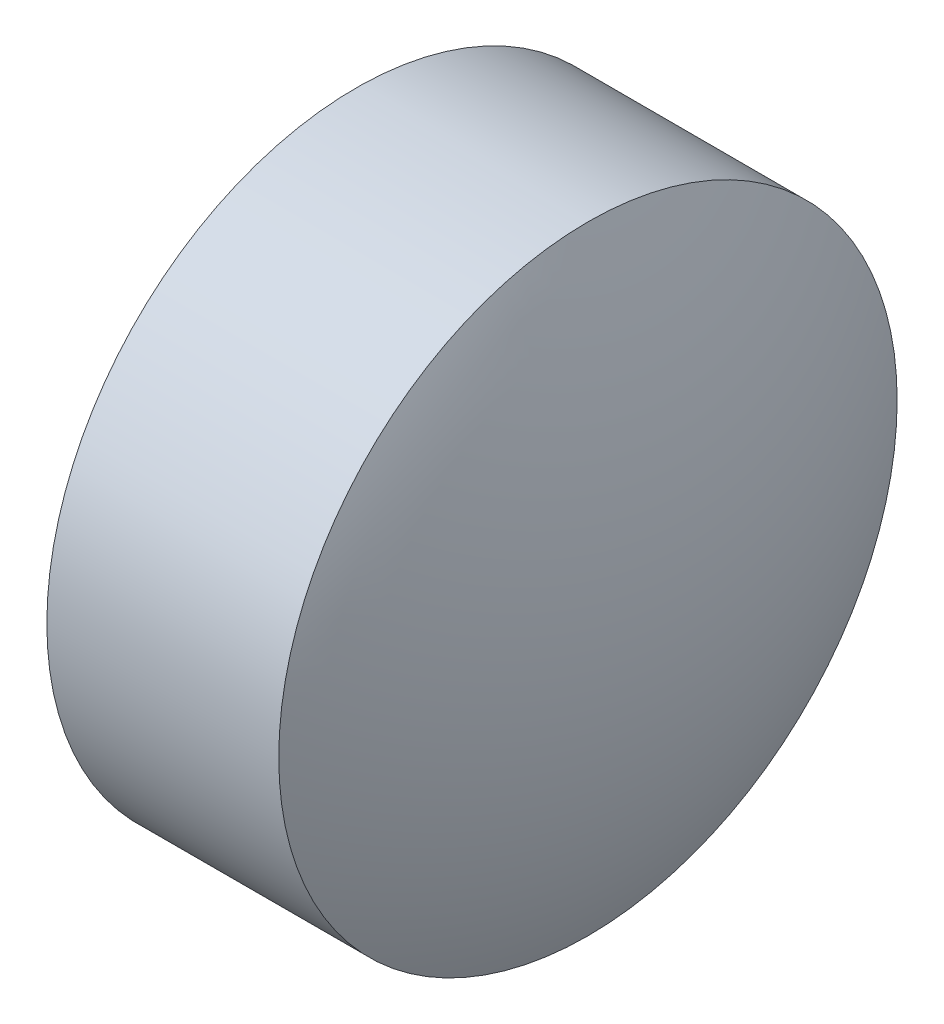
ISO-10303-21;
HEADER;
FILE_DESCRIPTION(('STEP AP214'),'2;1');
FILE_NAME('part.step','',(''),(''),'','','');
FILE_SCHEMA(('AUTOMOTIVE_DESIGN { 1 0 10303 214 1 1 1 1 }'));
ENDSEC;
DATA;
#1=APPLICATION_CONTEXT('core data for automotive mechanical design processes');
#2=APPLICATION_PROTOCOL_DEFINITION('international standard','automotive_design',2000,#1);
#3=PRODUCT_CONTEXT('',#1,'mechanical');
#4=PRODUCT('Part','Part','',(#3));
#5=PRODUCT_RELATED_PRODUCT_CATEGORY('part','',(#4));
#6=PRODUCT_DEFINITION_FORMATION('','',#4);
#7=PRODUCT_DEFINITION_CONTEXT('part definition',#1,'design');
#8=PRODUCT_DEFINITION('design','',#6,#7);
#9=PRODUCT_DEFINITION_SHAPE('','',#8);
#10=(LENGTH_UNIT() NAMED_UNIT(*) SI_UNIT(.MILLI.,.METRE.));
#11=(NAMED_UNIT(*) PLANE_ANGLE_UNIT() SI_UNIT($,.RADIAN.));
#12=(NAMED_UNIT(*) SI_UNIT($,.STERADIAN.) SOLID_ANGLE_UNIT());
#13=UNCERTAINTY_MEASURE_WITH_UNIT(LENGTH_MEASURE(1.E-05),#10,'distance_accuracy_value','');
#14=(GEOMETRIC_REPRESENTATION_CONTEXT(3) GLOBAL_UNCERTAINTY_ASSIGNED_CONTEXT((#13)) GLOBAL_UNIT_ASSIGNED_CONTEXT((#10,
#11,#12)) REPRESENTATION_CONTEXT('',''));
#15=CARTESIAN_POINT('',(0.,0.,0.));
#16=DIRECTION('',(0.,0.,1.));
#17=DIRECTION('',(1.,0.,0.));
#18=AXIS2_PLACEMENT_3D('',#15,#16,#17);
#19=CARTESIAN_POINT('',(414.367091633163,167.108864965034,0.));
#20=DIRECTION('',(-1.,0.,0.));
#21=DIRECTION('',(0.,1.,0.));
#22=AXIS2_PLACEMENT_3D('',#19,#20,#21);
#23=SPHERICAL_SURFACE('',#22,4.57782608695656);
#24=CARTESIAN_POINT('',(418.48491772012,167.108864965034,0.));
#25=DIRECTION('',(-1.,0.,0.));
#26=DIRECTION('',(0.,0.,1.));
#27=AXIS2_PLACEMENT_3D('',#24,#25,#26);
#28=CIRCLE('',#27,2.);
#29=CARTESIAN_POINT('',(418.48491772012,167.108864965034,2.));
#30=VERTEX_POINT('',#29);
#31=EDGE_CURVE('E10',#30,#30,#28,.T.);
#32=ORIENTED_EDGE('',*,*,#31,.F.);
#33=EDGE_LOOP('',(#32));
#34=FACE_BOUND('',#33,.T.);
#35=ADVANCED_FACE('F35',(#34),#23,.T.);
#36=CARTESIAN_POINT('',(416.556811026073,167.108864965034,0.));
#37=DIRECTION('',(-1.,0.,0.));
#38=DIRECTION('',(0.,0.,1.));
#39=AXIS2_PLACEMENT_3D('',#36,#37,#38);
#40=CYLINDRICAL_SURFACE('',#39,2.);
#41=CARTESIAN_POINT('',(416.98491772012,167.108864965034,0.));
#42=DIRECTION('',(-1.,0.,0.));
#43=DIRECTION('',(0.,0.,1.));
#44=AXIS2_PLACEMENT_3D('',#41,#42,#43);
#45=CIRCLE('',#44,2.);
#46=CARTESIAN_POINT('',(416.98491772012,167.108864965034,2.));
#47=VERTEX_POINT('',#46);
#48=EDGE_CURVE('E41',#47,#47,#45,.T.);
#49=ORIENTED_EDGE('',*,*,#48,.F.);
#50=EDGE_LOOP('',(#49));
#51=FACE_BOUND('',#50,.T.);
#52=ORIENTED_EDGE('',*,*,#31,.T.);
#53=EDGE_LOOP('',(#52));
#54=FACE_BOUND('',#53,.T.);
#55=ADVANCED_FACE('F49',(#51,#54),#40,.T.);
#56=CARTESIAN_POINT('',(416.98491772012,167.108864965034,0.));
#57=DIRECTION('',(1.,0.,0.));
#58=DIRECTION('',(0.,0.,-1.));
#59=AXIS2_PLACEMENT_3D('',#56,#57,#58);
#60=PLANE('',#59);
#61=ORIENTED_EDGE('',*,*,#48,.T.);
#62=EDGE_LOOP('',(#61));
#63=FACE_BOUND('',#62,.T.);
#64=ADVANCED_FACE('F47',(#63),#60,.F.);
#65=CLOSED_SHELL('',(#35,#55,#64));
#66=MANIFOLD_SOLID_BREP('B2',#65);
#67=ADVANCED_BREP_SHAPE_REPRESENTATION('',(#18,#66),#14);
#68=SHAPE_DEFINITION_REPRESENTATION(#9,#67);
ENDSEC;
END-ISO-10303-21;
